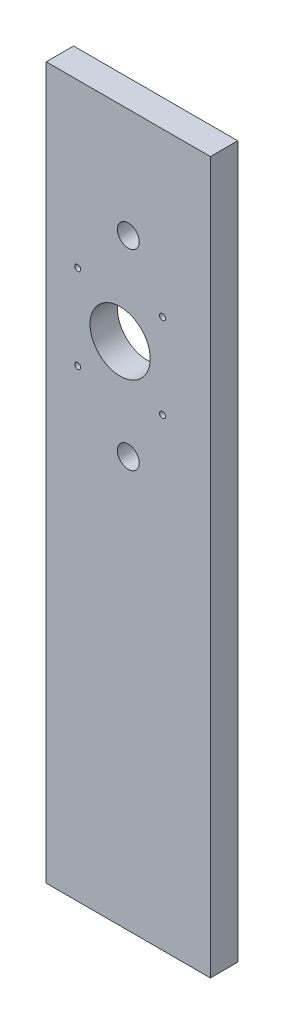
ISO-10303-21;
HEADER;
FILE_DESCRIPTION(('STEP AP214'),'2;1');
FILE_NAME('part.step','',(''),(''),'','','');
FILE_SCHEMA(('AUTOMOTIVE_DESIGN { 1 0 10303 214 1 1 1 1 }'));
ENDSEC;
DATA;
#1=APPLICATION_CONTEXT('core data for automotive mechanical design processes');
#2=APPLICATION_PROTOCOL_DEFINITION('international standard','automotive_design',2000,#1);
#3=PRODUCT_CONTEXT('',#1,'mechanical');
#4=PRODUCT('Part','Part','',(#3));
#5=PRODUCT_RELATED_PRODUCT_CATEGORY('part','',(#4));
#6=PRODUCT_DEFINITION_FORMATION('','',#4);
#7=PRODUCT_DEFINITION_CONTEXT('part definition',#1,'design');
#8=PRODUCT_DEFINITION('design','',#6,#7);
#9=PRODUCT_DEFINITION_SHAPE('','',#8);
#10=(LENGTH_UNIT() NAMED_UNIT(*) SI_UNIT(.MILLI.,.METRE.));
#11=(NAMED_UNIT(*) PLANE_ANGLE_UNIT() SI_UNIT($,.RADIAN.));
#12=(NAMED_UNIT(*) SI_UNIT($,.STERADIAN.) SOLID_ANGLE_UNIT());
#13=UNCERTAINTY_MEASURE_WITH_UNIT(LENGTH_MEASURE(1.E-05),#10,'distance_accuracy_value','');
#14=(GEOMETRIC_REPRESENTATION_CONTEXT(3) GLOBAL_UNCERTAINTY_ASSIGNED_CONTEXT((#13)) GLOBAL_UNIT_ASSIGNED_CONTEXT((#10,
#11,#12)) REPRESENTATION_CONTEXT('',''));
#15=CARTESIAN_POINT('',(0.,0.,0.));
#16=DIRECTION('',(0.,0.,1.));
#17=DIRECTION('',(1.,0.,0.));
#18=AXIS2_PLACEMENT_3D('',#15,#16,#17);
#19=CARTESIAN_POINT('',(0.,0.,10.));
#20=DIRECTION('',(0.,0.,1.));
#21=DIRECTION('',(1.,0.,0.));
#22=AXIS2_PLACEMENT_3D('',#19,#20,#21);
#23=PLANE('',#22);
#24=CARTESIAN_POINT('',(12.4999999999998,39.4999999999999,10.));
#25=DIRECTION('',(0.,0.,1.));
#26=DIRECTION('',(1.,0.,0.));
#27=AXIS2_PLACEMENT_3D('',#24,#25,#26);
#28=CIRCLE('',#27,1.09);
#29=CARTESIAN_POINT('',(13.5899999999998,39.4999999999999,10.));
#30=VERTEX_POINT('',#29);
#31=EDGE_CURVE('E137',#30,#30,#28,.T.);
#32=ORIENTED_EDGE('',*,*,#31,.F.);
#33=EDGE_LOOP('',(#32));
#34=FACE_BOUND('',#33,.T.);
#35=CARTESIAN_POINT('',(-18.5000000000002,70.4999999999999,10.));
#36=DIRECTION('',(0.,0.,1.));
#37=DIRECTION('',(1.,0.,0.));
#38=AXIS2_PLACEMENT_3D('',#35,#36,#37);
#39=CIRCLE('',#38,1.09);
#40=CARTESIAN_POINT('',(-17.4100000000002,70.4999999999999,10.));
#41=VERTEX_POINT('',#40);
#42=EDGE_CURVE('E125',#41,#41,#39,.T.);
#43=ORIENTED_EDGE('',*,*,#42,.F.);
#44=EDGE_LOOP('',(#43));
#45=FACE_BOUND('',#44,.T.);
#46=CARTESIAN_POINT('',(0.,89.9999999999999,10.));
#47=DIRECTION('',(0.,0.,1.));
#48=DIRECTION('',(1.,0.,0.));
#49=AXIS2_PLACEMENT_3D('',#46,#47,#48);
#50=CIRCLE('',#49,4.);
#51=CARTESIAN_POINT('',(4.,89.9999999999999,10.));
#52=VERTEX_POINT('',#51);
#53=EDGE_CURVE('E113',#52,#52,#50,.T.);
#54=ORIENTED_EDGE('',*,*,#53,.F.);
#55=EDGE_LOOP('',(#54));
#56=FACE_BOUND('',#55,.T.);
#57=DIRECTION('',(0.,1.,0.));
#58=VECTOR('',#57,1.);
#59=CARTESIAN_POINT('',(29.9999999999999,130.,10.));
#60=LINE('',#59,#58);
#61=CARTESIAN_POINT('',(30.,-130.,10.));
#62=VERTEX_POINT('',#61);
#63=CARTESIAN_POINT('',(29.9999999999999,130.,10.));
#64=VERTEX_POINT('',#63);
#65=EDGE_CURVE('E83',#62,#64,#60,.T.);
#66=ORIENTED_EDGE('',*,*,#65,.T.);
#67=DIRECTION('',(-1.,0.,0.));
#68=VECTOR('',#67,1.);
#69=CARTESIAN_POINT('',(-29.9999999999999,130.,10.));
#70=LINE('',#69,#68);
#71=CARTESIAN_POINT('',(-29.9999999999999,130.,10.));
#72=VERTEX_POINT('',#71);
#73=EDGE_CURVE('E78',#64,#72,#70,.T.);
#74=ORIENTED_EDGE('',*,*,#73,.T.);
#75=DIRECTION('',(0.,-1.,0.));
#76=VECTOR('',#75,1.);
#77=CARTESIAN_POINT('',(-29.9999999999999,130.,10.));
#78=LINE('',#77,#76);
#79=CARTESIAN_POINT('',(-30.,-130.,10.));
#80=VERTEX_POINT('',#79);
#81=EDGE_CURVE('E81',#72,#80,#78,.T.);
#82=ORIENTED_EDGE('',*,*,#81,.T.);
#83=DIRECTION('',(1.,0.,0.));
#84=VECTOR('',#83,1.);
#85=CARTESIAN_POINT('',(-30.,-130.,10.));
#86=LINE('',#85,#84);
#87=EDGE_CURVE('E48',#80,#62,#86,.T.);
#88=ORIENTED_EDGE('',*,*,#87,.T.);
#89=EDGE_LOOP('',(#66,#74,#82,#88));
#90=FACE_BOUND('',#89,.T.);
#91=CARTESIAN_POINT('',(-2.99999999999999,54.9999999999999,10.));
#92=DIRECTION('',(0.,0.,1.));
#93=DIRECTION('',(1.,0.,0.));
#94=AXIS2_PLACEMENT_3D('',#91,#92,#93);
#95=CIRCLE('',#94,11.);
#96=CARTESIAN_POINT('',(8.00000000000001,54.9999999999999,10.));
#97=VERTEX_POINT('',#96);
#98=EDGE_CURVE('E98',#97,#97,#95,.T.);
#99=ORIENTED_EDGE('',*,*,#98,.F.);
#100=EDGE_LOOP('',(#99));
#101=FACE_BOUND('',#100,.T.);
#102=CARTESIAN_POINT('',(0.,19.9999999999999,10.));
#103=DIRECTION('',(0.,0.,1.));
#104=DIRECTION('',(1.,0.,0.));
#105=AXIS2_PLACEMENT_3D('',#102,#103,#104);
#106=CIRCLE('',#105,4.);
#107=CARTESIAN_POINT('',(4.00000000000001,19.9999999999999,10.));
#108=VERTEX_POINT('',#107);
#109=EDGE_CURVE('E119',#108,#108,#106,.T.);
#110=ORIENTED_EDGE('',*,*,#109,.F.);
#111=EDGE_LOOP('',(#110));
#112=FACE_BOUND('',#111,.T.);
#113=CARTESIAN_POINT('',(12.4999999999998,70.4999999999999,10.));
#114=DIRECTION('',(0.,0.,1.));
#115=DIRECTION('',(1.,0.,0.));
#116=AXIS2_PLACEMENT_3D('',#113,#114,#115);
#117=CIRCLE('',#116,1.09);
#118=CARTESIAN_POINT('',(13.5899999999998,70.4999999999999,10.));
#119=VERTEX_POINT('',#118);
#120=EDGE_CURVE('E131',#119,#119,#117,.T.);
#121=ORIENTED_EDGE('',*,*,#120,.F.);
#122=EDGE_LOOP('',(#121));
#123=FACE_BOUND('',#122,.T.);
#124=CARTESIAN_POINT('',(-18.5000000000002,39.4999999999999,10.));
#125=DIRECTION('',(0.,0.,1.));
#126=DIRECTION('',(1.,0.,0.));
#127=AXIS2_PLACEMENT_3D('',#124,#125,#126);
#128=CIRCLE('',#127,1.09);
#129=CARTESIAN_POINT('',(-17.4100000000002,39.4999999999999,10.));
#130=VERTEX_POINT('',#129);
#131=EDGE_CURVE('E143',#130,#130,#128,.T.);
#132=ORIENTED_EDGE('',*,*,#131,.F.);
#133=EDGE_LOOP('',(#132));
#134=FACE_BOUND('',#133,.T.);
#135=ADVANCED_FACE('F31',(#34,#45,#56,#90,#101,#112,#123,#134),#23,.T.);
#136=CARTESIAN_POINT('',(0.,0.,0.));
#137=DIRECTION('',(0.,0.,1.));
#138=DIRECTION('',(1.,0.,0.));
#139=AXIS2_PLACEMENT_3D('',#136,#137,#138);
#140=PLANE('',#139);
#141=DIRECTION('',(0.,1.,0.));
#142=VECTOR('',#141,1.);
#143=CARTESIAN_POINT('',(29.9999999999999,130.,0.));
#144=LINE('',#143,#142);
#145=CARTESIAN_POINT('',(30.,-130.,0.));
#146=VERTEX_POINT('',#145);
#147=CARTESIAN_POINT('',(29.9999999999999,130.,0.));
#148=VERTEX_POINT('',#147);
#149=EDGE_CURVE('E95',#146,#148,#144,.T.);
#150=ORIENTED_EDGE('',*,*,#149,.F.);
#151=DIRECTION('',(1.,0.,0.));
#152=VECTOR('',#151,1.);
#153=CARTESIAN_POINT('',(-30.,-130.,0.));
#154=LINE('',#153,#152);
#155=CARTESIAN_POINT('',(-30.,-130.,0.));
#156=VERTEX_POINT('',#155);
#157=EDGE_CURVE('E71',#156,#146,#154,.T.);
#158=ORIENTED_EDGE('',*,*,#157,.F.);
#159=DIRECTION('',(0.,-1.,0.));
#160=VECTOR('',#159,1.);
#161=CARTESIAN_POINT('',(-29.9999999999999,130.,0.));
#162=LINE('',#161,#160);
#163=CARTESIAN_POINT('',(-29.9999999999999,130.,0.));
#164=VERTEX_POINT('',#163);
#165=EDGE_CURVE('E65',#164,#156,#162,.T.);
#166=ORIENTED_EDGE('',*,*,#165,.F.);
#167=DIRECTION('',(-1.,0.,0.));
#168=VECTOR('',#167,1.);
#169=CARTESIAN_POINT('',(-29.9999999999999,130.,0.));
#170=LINE('',#169,#168);
#171=EDGE_CURVE('E87',#148,#164,#170,.T.);
#172=ORIENTED_EDGE('',*,*,#171,.F.);
#173=EDGE_LOOP('',(#150,#158,#166,#172));
#174=FACE_BOUND('',#173,.T.);
#175=CARTESIAN_POINT('',(-2.99999999999999,54.9999999999999,0.));
#176=DIRECTION('',(0.,0.,1.));
#177=DIRECTION('',(1.,0.,0.));
#178=AXIS2_PLACEMENT_3D('',#175,#176,#177);
#179=CIRCLE('',#178,11.);
#180=CARTESIAN_POINT('',(8.00000000000001,54.9999999999999,0.));
#181=VERTEX_POINT('',#180);
#182=EDGE_CURVE('E110',#181,#181,#179,.T.);
#183=ORIENTED_EDGE('',*,*,#182,.T.);
#184=EDGE_LOOP('',(#183));
#185=FACE_BOUND('',#184,.T.);
#186=CARTESIAN_POINT('',(0.,89.9999999999999,0.));
#187=DIRECTION('',(0.,0.,1.));
#188=DIRECTION('',(1.,0.,0.));
#189=AXIS2_PLACEMENT_3D('',#186,#187,#188);
#190=CIRCLE('',#189,4.);
#191=CARTESIAN_POINT('',(4.,89.9999999999999,0.));
#192=VERTEX_POINT('',#191);
#193=EDGE_CURVE('E116',#192,#192,#190,.T.);
#194=ORIENTED_EDGE('',*,*,#193,.T.);
#195=EDGE_LOOP('',(#194));
#196=FACE_BOUND('',#195,.T.);
#197=CARTESIAN_POINT('',(0.,19.9999999999999,0.));
#198=DIRECTION('',(0.,0.,1.));
#199=DIRECTION('',(1.,0.,0.));
#200=AXIS2_PLACEMENT_3D('',#197,#198,#199);
#201=CIRCLE('',#200,4.);
#202=CARTESIAN_POINT('',(4.00000000000001,19.9999999999999,0.));
#203=VERTEX_POINT('',#202);
#204=EDGE_CURVE('E122',#203,#203,#201,.T.);
#205=ORIENTED_EDGE('',*,*,#204,.T.);
#206=EDGE_LOOP('',(#205));
#207=FACE_BOUND('',#206,.T.);
#208=CARTESIAN_POINT('',(-18.5000000000002,70.4999999999999,0.));
#209=DIRECTION('',(0.,0.,1.));
#210=DIRECTION('',(1.,0.,0.));
#211=AXIS2_PLACEMENT_3D('',#208,#209,#210);
#212=CIRCLE('',#211,1.09);
#213=CARTESIAN_POINT('',(-17.4100000000002,70.4999999999999,0.));
#214=VERTEX_POINT('',#213);
#215=EDGE_CURVE('E128',#214,#214,#212,.T.);
#216=ORIENTED_EDGE('',*,*,#215,.T.);
#217=EDGE_LOOP('',(#216));
#218=FACE_BOUND('',#217,.T.);
#219=CARTESIAN_POINT('',(12.4999999999998,70.4999999999999,0.));
#220=DIRECTION('',(0.,0.,1.));
#221=DIRECTION('',(1.,0.,0.));
#222=AXIS2_PLACEMENT_3D('',#219,#220,#221);
#223=CIRCLE('',#222,1.09);
#224=CARTESIAN_POINT('',(13.5899999999998,70.4999999999999,0.));
#225=VERTEX_POINT('',#224);
#226=EDGE_CURVE('E134',#225,#225,#223,.T.);
#227=ORIENTED_EDGE('',*,*,#226,.T.);
#228=EDGE_LOOP('',(#227));
#229=FACE_BOUND('',#228,.T.);
#230=CARTESIAN_POINT('',(12.4999999999998,39.4999999999999,0.));
#231=DIRECTION('',(0.,0.,1.));
#232=DIRECTION('',(1.,0.,0.));
#233=AXIS2_PLACEMENT_3D('',#230,#231,#232);
#234=CIRCLE('',#233,1.09);
#235=CARTESIAN_POINT('',(13.5899999999998,39.4999999999999,0.));
#236=VERTEX_POINT('',#235);
#237=EDGE_CURVE('E140',#236,#236,#234,.T.);
#238=ORIENTED_EDGE('',*,*,#237,.T.);
#239=EDGE_LOOP('',(#238));
#240=FACE_BOUND('',#239,.T.);
#241=CARTESIAN_POINT('',(-18.5000000000002,39.4999999999999,0.));
#242=DIRECTION('',(0.,0.,1.));
#243=DIRECTION('',(1.,0.,0.));
#244=AXIS2_PLACEMENT_3D('',#241,#242,#243);
#245=CIRCLE('',#244,1.09);
#246=CARTESIAN_POINT('',(-17.4100000000002,39.4999999999999,0.));
#247=VERTEX_POINT('',#246);
#248=EDGE_CURVE('E146',#247,#247,#245,.T.);
#249=ORIENTED_EDGE('',*,*,#248,.T.);
#250=EDGE_LOOP('',(#249));
#251=FACE_BOUND('',#250,.T.);
#252=ADVANCED_FACE('F106',(#174,#185,#196,#207,#218,#229,#240,#251),#140,.F.);
#253=CARTESIAN_POINT('',(29.9999999999999,130.,10.));
#254=DIRECTION('',(-1.,0.,0.));
#255=DIRECTION('',(0.,-1.,0.));
#256=AXIS2_PLACEMENT_3D('',#253,#254,#255);
#257=PLANE('',#256);
#258=ORIENTED_EDGE('',*,*,#149,.T.);
#259=DIRECTION('',(0.,0.,-1.));
#260=VECTOR('',#259,1.);
#261=CARTESIAN_POINT('',(29.9999999999999,130.,10.));
#262=LINE('',#261,#260);
#263=EDGE_CURVE('E11',#64,#148,#262,.T.);
#264=ORIENTED_EDGE('',*,*,#263,.F.);
#265=ORIENTED_EDGE('',*,*,#65,.F.);
#266=DIRECTION('',(0.,0.,-1.));
#267=VECTOR('',#266,1.);
#268=CARTESIAN_POINT('',(30.,-130.,10.));
#269=LINE('',#268,#267);
#270=EDGE_CURVE('E91',#62,#146,#269,.T.);
#271=ORIENTED_EDGE('',*,*,#270,.T.);
#272=EDGE_LOOP('',(#258,#264,#265,#271));
#273=FACE_BOUND('',#272,.T.);
#274=ADVANCED_FACE('F33',(#273),#257,.F.);
#275=CARTESIAN_POINT('',(-29.9999999999999,130.,10.));
#276=DIRECTION('',(0.,-1.,0.));
#277=DIRECTION('',(0.,0.,-1.));
#278=AXIS2_PLACEMENT_3D('',#275,#276,#277);
#279=PLANE('',#278);
#280=ORIENTED_EDGE('',*,*,#171,.T.);
#281=DIRECTION('',(0.,0.,-1.));
#282=VECTOR('',#281,1.);
#283=CARTESIAN_POINT('',(-29.9999999999999,130.,10.));
#284=LINE('',#283,#282);
#285=EDGE_CURVE('E40',#72,#164,#284,.T.);
#286=ORIENTED_EDGE('',*,*,#285,.F.);
#287=ORIENTED_EDGE('',*,*,#73,.F.);
#288=ORIENTED_EDGE('',*,*,#263,.T.);
#289=EDGE_LOOP('',(#280,#286,#287,#288));
#290=FACE_BOUND('',#289,.T.);
#291=ADVANCED_FACE('F86',(#290),#279,.F.);
#292=CARTESIAN_POINT('',(-29.9999999999999,130.,10.));
#293=DIRECTION('',(1.,0.,0.));
#294=DIRECTION('',(0.,1.,0.));
#295=AXIS2_PLACEMENT_3D('',#292,#293,#294);
#296=PLANE('',#295);
#297=ORIENTED_EDGE('',*,*,#165,.T.);
#298=DIRECTION('',(0.,0.,-1.));
#299=VECTOR('',#298,1.);
#300=CARTESIAN_POINT('',(-30.,-130.,10.));
#301=LINE('',#300,#299);
#302=EDGE_CURVE('E88',#80,#156,#301,.T.);
#303=ORIENTED_EDGE('',*,*,#302,.F.);
#304=ORIENTED_EDGE('',*,*,#81,.F.);
#305=ORIENTED_EDGE('',*,*,#285,.T.);
#306=EDGE_LOOP('',(#297,#303,#304,#305));
#307=FACE_BOUND('',#306,.T.);
#308=ADVANCED_FACE('F89',(#307),#296,.F.);
#309=CARTESIAN_POINT('',(-30.,-130.,10.));
#310=DIRECTION('',(0.,1.,0.));
#311=DIRECTION('',(-1.,0.,0.));
#312=AXIS2_PLACEMENT_3D('',#309,#310,#311);
#313=PLANE('',#312);
#314=ORIENTED_EDGE('',*,*,#157,.T.);
#315=ORIENTED_EDGE('',*,*,#270,.F.);
#316=ORIENTED_EDGE('',*,*,#87,.F.);
#317=ORIENTED_EDGE('',*,*,#302,.T.);
#318=EDGE_LOOP('',(#314,#315,#316,#317));
#319=FACE_BOUND('',#318,.T.);
#320=ADVANCED_FACE('F103',(#319),#313,.F.);
#321=CARTESIAN_POINT('',(-2.99999999999999,54.9999999999999,10.));
#322=DIRECTION('',(0.,0.,-1.));
#323=DIRECTION('',(-1.,0.,0.));
#324=AXIS2_PLACEMENT_3D('',#321,#322,#323);
#325=CYLINDRICAL_SURFACE('',#324,11.);
#326=ORIENTED_EDGE('',*,*,#98,.T.);
#327=EDGE_LOOP('',(#326));
#328=FACE_BOUND('',#327,.T.);
#329=ORIENTED_EDGE('',*,*,#182,.F.);
#330=EDGE_LOOP('',(#329));
#331=FACE_BOUND('',#330,.T.);
#332=ADVANCED_FACE('F165',(#328,#331),#325,.F.);
#333=CARTESIAN_POINT('',(0.,89.9999999999999,10.));
#334=DIRECTION('',(0.,0.,-1.));
#335=DIRECTION('',(-1.,0.,0.));
#336=AXIS2_PLACEMENT_3D('',#333,#334,#335);
#337=CYLINDRICAL_SURFACE('',#336,4.);
#338=ORIENTED_EDGE('',*,*,#53,.T.);
#339=EDGE_LOOP('',(#338));
#340=FACE_BOUND('',#339,.T.);
#341=ORIENTED_EDGE('',*,*,#193,.F.);
#342=EDGE_LOOP('',(#341));
#343=FACE_BOUND('',#342,.T.);
#344=ADVANCED_FACE('F211',(#340,#343),#337,.F.);
#345=CARTESIAN_POINT('',(0.,19.9999999999999,10.));
#346=DIRECTION('',(0.,0.,-1.));
#347=DIRECTION('',(-1.,0.,0.));
#348=AXIS2_PLACEMENT_3D('',#345,#346,#347);
#349=CYLINDRICAL_SURFACE('',#348,4.);
#350=ORIENTED_EDGE('',*,*,#109,.T.);
#351=EDGE_LOOP('',(#350));
#352=FACE_BOUND('',#351,.T.);
#353=ORIENTED_EDGE('',*,*,#204,.F.);
#354=EDGE_LOOP('',(#353));
#355=FACE_BOUND('',#354,.T.);
#356=ADVANCED_FACE('F219',(#352,#355),#349,.F.);
#357=CARTESIAN_POINT('',(-18.5000000000002,70.4999999999999,10.));
#358=DIRECTION('',(0.,0.,-1.));
#359=DIRECTION('',(-1.,0.,0.));
#360=AXIS2_PLACEMENT_3D('',#357,#358,#359);
#361=CYLINDRICAL_SURFACE('',#360,1.09);
#362=ORIENTED_EDGE('',*,*,#42,.T.);
#363=EDGE_LOOP('',(#362));
#364=FACE_BOUND('',#363,.T.);
#365=ORIENTED_EDGE('',*,*,#215,.F.);
#366=EDGE_LOOP('',(#365));
#367=FACE_BOUND('',#366,.T.);
#368=ADVANCED_FACE('F227',(#364,#367),#361,.F.);
#369=CARTESIAN_POINT('',(12.4999999999998,70.4999999999999,10.));
#370=DIRECTION('',(0.,0.,-1.));
#371=DIRECTION('',(-1.,0.,0.));
#372=AXIS2_PLACEMENT_3D('',#369,#370,#371);
#373=CYLINDRICAL_SURFACE('',#372,1.09);
#374=ORIENTED_EDGE('',*,*,#120,.T.);
#375=EDGE_LOOP('',(#374));
#376=FACE_BOUND('',#375,.T.);
#377=ORIENTED_EDGE('',*,*,#226,.F.);
#378=EDGE_LOOP('',(#377));
#379=FACE_BOUND('',#378,.T.);
#380=ADVANCED_FACE('F236',(#376,#379),#373,.F.);
#381=CARTESIAN_POINT('',(12.4999999999998,39.4999999999999,10.));
#382=DIRECTION('',(0.,0.,-1.));
#383=DIRECTION('',(-1.,0.,0.));
#384=AXIS2_PLACEMENT_3D('',#381,#382,#383);
#385=CYLINDRICAL_SURFACE('',#384,1.09);
#386=ORIENTED_EDGE('',*,*,#31,.T.);
#387=EDGE_LOOP('',(#386));
#388=FACE_BOUND('',#387,.T.);
#389=ORIENTED_EDGE('',*,*,#237,.F.);
#390=EDGE_LOOP('',(#389));
#391=FACE_BOUND('',#390,.T.);
#392=ADVANCED_FACE('F245',(#388,#391),#385,.F.);
#393=CARTESIAN_POINT('',(-18.5000000000002,39.4999999999999,10.));
#394=DIRECTION('',(0.,0.,-1.));
#395=DIRECTION('',(-1.,0.,0.));
#396=AXIS2_PLACEMENT_3D('',#393,#394,#395);
#397=CYLINDRICAL_SURFACE('',#396,1.09);
#398=ORIENTED_EDGE('',*,*,#131,.T.);
#399=EDGE_LOOP('',(#398));
#400=FACE_BOUND('',#399,.T.);
#401=ORIENTED_EDGE('',*,*,#248,.F.);
#402=EDGE_LOOP('',(#401));
#403=FACE_BOUND('',#402,.T.);
#404=ADVANCED_FACE('F152',(#400,#403),#397,.F.);
#405=CLOSED_SHELL('',(#135,#252,#274,#291,#308,#320,#332,#344,#356,#368,#380,#392,#404));
#406=MANIFOLD_SOLID_BREP('B2',#405);
#407=ADVANCED_BREP_SHAPE_REPRESENTATION('',(#18,#406),#14);
#408=SHAPE_DEFINITION_REPRESENTATION(#9,#407);
ENDSEC;
END-ISO-10303-21;
